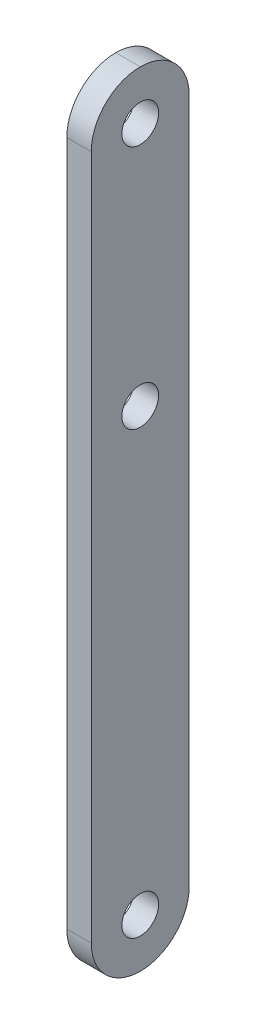
ISO-10303-21;
HEADER;
FILE_DESCRIPTION(('STEP AP214'),'2;1');
FILE_NAME('part.step','',(''),(''),'','','');
FILE_SCHEMA(('AUTOMOTIVE_DESIGN { 1 0 10303 214 1 1 1 1 }'));
ENDSEC;
DATA;
#1=APPLICATION_CONTEXT('core data for automotive mechanical design processes');
#2=APPLICATION_PROTOCOL_DEFINITION('international standard','automotive_design',2000,#1);
#3=PRODUCT_CONTEXT('',#1,'mechanical');
#4=PRODUCT('Part','Part','',(#3));
#5=PRODUCT_RELATED_PRODUCT_CATEGORY('part','',(#4));
#6=PRODUCT_DEFINITION_FORMATION('','',#4);
#7=PRODUCT_DEFINITION_CONTEXT('part definition',#1,'design');
#8=PRODUCT_DEFINITION('design','',#6,#7);
#9=PRODUCT_DEFINITION_SHAPE('','',#8);
#10=(LENGTH_UNIT() NAMED_UNIT(*) SI_UNIT(.MILLI.,.METRE.));
#11=(NAMED_UNIT(*) PLANE_ANGLE_UNIT() SI_UNIT($,.RADIAN.));
#12=(NAMED_UNIT(*) SI_UNIT($,.STERADIAN.) SOLID_ANGLE_UNIT());
#13=UNCERTAINTY_MEASURE_WITH_UNIT(LENGTH_MEASURE(1.E-05),#10,'distance_accuracy_value','');
#14=(GEOMETRIC_REPRESENTATION_CONTEXT(3) GLOBAL_UNCERTAINTY_ASSIGNED_CONTEXT((#13)) GLOBAL_UNIT_ASSIGNED_CONTEXT((#10,
#11,#12)) REPRESENTATION_CONTEXT('',''));
#15=CARTESIAN_POINT('',(0.,0.,0.));
#16=DIRECTION('',(0.,0.,1.));
#17=DIRECTION('',(1.,0.,0.));
#18=AXIS2_PLACEMENT_3D('',#15,#16,#17);
#19=CARTESIAN_POINT('',(6.35,203.2,-25.4));
#20=DIRECTION('',(0.,0.,1.));
#21=DIRECTION('',(0.,-1.,0.));
#22=AXIS2_PLACEMENT_3D('',#19,#20,#21);
#23=PLANE('',#22);
#24=DIRECTION('',(0.,1.,0.));
#25=VECTOR('',#24,1.);
#26=CARTESIAN_POINT('',(6.35,203.2,-25.4));
#27=LINE('',#26,#25);
#28=CARTESIAN_POINT('',(6.35,-177.8,-25.4));
#29=VERTEX_POINT('',#28);
#30=CARTESIAN_POINT('',(6.35,177.8,-25.4));
#31=VERTEX_POINT('',#30);
#32=EDGE_CURVE('E106',#29,#31,#27,.T.);
#33=ORIENTED_EDGE('',*,*,#32,.F.);
#34=DIRECTION('',(-1.,0.,0.));
#35=VECTOR('',#34,1.);
#36=CARTESIAN_POINT('',(6.35,-177.8,-25.4));
#37=LINE('',#36,#35);
#38=CARTESIAN_POINT('',(-6.35,-177.8,-25.4));
#39=VERTEX_POINT('',#38);
#40=EDGE_CURVE('E92',#29,#39,#37,.T.);
#41=ORIENTED_EDGE('',*,*,#40,.T.);
#42=DIRECTION('',(0.,1.,0.));
#43=VECTOR('',#42,1.);
#44=CARTESIAN_POINT('',(-6.35,203.2,-25.4));
#45=LINE('',#44,#43);
#46=CARTESIAN_POINT('',(-6.35,177.8,-25.4));
#47=VERTEX_POINT('',#46);
#48=EDGE_CURVE('E103',#39,#47,#45,.T.);
#49=ORIENTED_EDGE('',*,*,#48,.T.);
#50=DIRECTION('',(-1.,0.,0.));
#51=VECTOR('',#50,1.);
#52=CARTESIAN_POINT('',(6.35,177.8,-25.4));
#53=LINE('',#52,#51);
#54=EDGE_CURVE('E108',#47,#31,#53,.F.);
#55=ORIENTED_EDGE('',*,*,#54,.T.);
#56=EDGE_LOOP('',(#33,#41,#49,#55));
#57=FACE_BOUND('',#56,.T.);
#58=ADVANCED_FACE('F33',(#57),#23,.F.);
#59=CARTESIAN_POINT('',(6.35,203.2,25.4));
#60=DIRECTION('',(0.,0.,-1.));
#61=DIRECTION('',(0.,1.,0.));
#62=AXIS2_PLACEMENT_3D('',#59,#60,#61);
#63=PLANE('',#62);
#64=DIRECTION('',(0.,-1.,0.));
#65=VECTOR('',#64,1.);
#66=CARTESIAN_POINT('',(-6.35,203.2,25.4));
#67=LINE('',#66,#65);
#68=CARTESIAN_POINT('',(-6.35,177.8,25.4));
#69=VERTEX_POINT('',#68);
#70=CARTESIAN_POINT('',(-6.35,-177.8,25.4));
#71=VERTEX_POINT('',#70);
#72=EDGE_CURVE('E112',#69,#71,#67,.T.);
#73=ORIENTED_EDGE('',*,*,#72,.T.);
#74=DIRECTION('',(-1.,0.,0.));
#75=VECTOR('',#74,1.);
#76=CARTESIAN_POINT('',(6.35,-177.8,25.4));
#77=LINE('',#76,#75);
#78=CARTESIAN_POINT('',(6.35,-177.8,25.4));
#79=VERTEX_POINT('',#78);
#80=EDGE_CURVE('E11',#71,#79,#77,.F.);
#81=ORIENTED_EDGE('',*,*,#80,.T.);
#82=DIRECTION('',(0.,-1.,0.));
#83=VECTOR('',#82,1.);
#84=CARTESIAN_POINT('',(6.35,203.2,25.4));
#85=LINE('',#84,#83);
#86=CARTESIAN_POINT('',(6.35,177.8,25.4));
#87=VERTEX_POINT('',#86);
#88=EDGE_CURVE('E120',#87,#79,#85,.T.);
#89=ORIENTED_EDGE('',*,*,#88,.F.);
#90=DIRECTION('',(-1.,0.,0.));
#91=VECTOR('',#90,1.);
#92=CARTESIAN_POINT('',(6.35,177.8,25.4));
#93=LINE('',#92,#91);
#94=EDGE_CURVE('E42',#87,#69,#93,.T.);
#95=ORIENTED_EDGE('',*,*,#94,.T.);
#96=EDGE_LOOP('',(#73,#81,#89,#95));
#97=FACE_BOUND('',#96,.T.);
#98=ADVANCED_FACE('F181',(#97),#63,.F.);
#99=CARTESIAN_POINT('',(6.35,0.,0.));
#100=DIRECTION('',(1.,0.,0.));
#101=DIRECTION('',(0.,0.,-1.));
#102=AXIS2_PLACEMENT_3D('',#99,#100,#101);
#103=PLANE('',#102);
#104=CARTESIAN_POINT('',(6.35,-177.8,0.));
#105=DIRECTION('',(1.,0.,0.));
#106=DIRECTION('',(0.,0.,-1.));
#107=AXIS2_PLACEMENT_3D('',#104,#105,#106);
#108=CIRCLE('',#107,9.52499999999998);
#109=CARTESIAN_POINT('',(6.35,-177.8,-9.52500000000003));
#110=VERTEX_POINT('',#109);
#111=EDGE_CURVE('E135',#110,#110,#108,.T.);
#112=ORIENTED_EDGE('',*,*,#111,.F.);
#113=EDGE_LOOP('',(#112));
#114=FACE_BOUND('',#113,.T.);
#115=CARTESIAN_POINT('',(6.35,50.8,0.));
#116=DIRECTION('',(1.,0.,0.));
#117=DIRECTION('',(0.,0.,-1.));
#118=AXIS2_PLACEMENT_3D('',#115,#116,#117);
#119=CIRCLE('',#118,9.52500000000001);
#120=CARTESIAN_POINT('',(6.35,50.8,-9.52500000000002));
#121=VERTEX_POINT('',#120);
#122=EDGE_CURVE('E154',#121,#121,#119,.T.);
#123=ORIENTED_EDGE('',*,*,#122,.F.);
#124=EDGE_LOOP('',(#123));
#125=FACE_BOUND('',#124,.T.);
#126=CARTESIAN_POINT('',(6.35,177.8,0.));
#127=DIRECTION('',(1.,0.,0.));
#128=DIRECTION('',(0.,0.,-1.));
#129=AXIS2_PLACEMENT_3D('',#126,#127,#128);
#130=CIRCLE('',#129,9.52499999999999);
#131=CARTESIAN_POINT('',(6.35,177.8,-9.52500000000003));
#132=VERTEX_POINT('',#131);
#133=EDGE_CURVE('E117',#132,#132,#130,.T.);
#134=ORIENTED_EDGE('',*,*,#133,.F.);
#135=EDGE_LOOP('',(#134));
#136=FACE_BOUND('',#135,.T.);
#137=CARTESIAN_POINT('',(6.35,-177.8,0.));
#138=DIRECTION('',(1.,0.,0.));
#139=DIRECTION('',(0.,0.,-1.));
#140=AXIS2_PLACEMENT_3D('',#137,#138,#139);
#141=CIRCLE('',#140,25.4);
#142=CARTESIAN_POINT('',(6.35,-203.2,0.));
#143=VERTEX_POINT('',#142);
#144=EDGE_CURVE('E50',#79,#143,#141,.T.);
#145=ORIENTED_EDGE('',*,*,#144,.T.);
#146=CARTESIAN_POINT('',(6.35,-177.8,0.));
#147=DIRECTION('',(1.,0.,0.));
#148=DIRECTION('',(0.,0.,-1.));
#149=AXIS2_PLACEMENT_3D('',#146,#147,#148);
#150=CIRCLE('',#149,25.4);
#151=EDGE_CURVE('E132',#143,#29,#150,.T.);
#152=ORIENTED_EDGE('',*,*,#151,.T.);
#153=ORIENTED_EDGE('',*,*,#32,.T.);
#154=CARTESIAN_POINT('',(6.35,177.8,0.));
#155=DIRECTION('',(1.,0.,0.));
#156=DIRECTION('',(0.,0.,-1.));
#157=AXIS2_PLACEMENT_3D('',#154,#155,#156);
#158=CIRCLE('',#157,25.4);
#159=CARTESIAN_POINT('',(6.35,203.2,0.));
#160=VERTEX_POINT('',#159);
#161=EDGE_CURVE('E97',#31,#160,#158,.T.);
#162=ORIENTED_EDGE('',*,*,#161,.T.);
#163=CARTESIAN_POINT('',(6.35,177.8,0.));
#164=DIRECTION('',(1.,0.,0.));
#165=DIRECTION('',(0.,0.,-1.));
#166=AXIS2_PLACEMENT_3D('',#163,#164,#165);
#167=CIRCLE('',#166,25.4);
#168=EDGE_CURVE('E129',#160,#87,#167,.T.);
#169=ORIENTED_EDGE('',*,*,#168,.T.);
#170=ORIENTED_EDGE('',*,*,#88,.T.);
#171=EDGE_LOOP('',(#145,#152,#153,#162,#169,#170));
#172=FACE_BOUND('',#171,.T.);
#173=ADVANCED_FACE('F147',(#114,#125,#136,#172),#103,.T.);
#174=CARTESIAN_POINT('',(-6.35,0.,0.));
#175=DIRECTION('',(1.,0.,0.));
#176=DIRECTION('',(0.,0.,-1.));
#177=AXIS2_PLACEMENT_3D('',#174,#175,#176);
#178=PLANE('',#177);
#179=CARTESIAN_POINT('',(-6.35,-177.8,0.));
#180=DIRECTION('',(1.,0.,0.));
#181=DIRECTION('',(0.,0.,-1.));
#182=AXIS2_PLACEMENT_3D('',#179,#180,#181);
#183=CIRCLE('',#182,9.52499999999998);
#184=CARTESIAN_POINT('',(-6.35,-177.8,-9.52500000000003));
#185=VERTEX_POINT('',#184);
#186=EDGE_CURVE('E137',#185,#185,#183,.F.);
#187=ORIENTED_EDGE('',*,*,#186,.F.);
#188=EDGE_LOOP('',(#187));
#189=FACE_BOUND('',#188,.T.);
#190=CARTESIAN_POINT('',(-6.35,50.8,0.));
#191=DIRECTION('',(1.,0.,0.));
#192=DIRECTION('',(0.,0.,-1.));
#193=AXIS2_PLACEMENT_3D('',#190,#191,#192);
#194=CIRCLE('',#193,9.52500000000001);
#195=CARTESIAN_POINT('',(-6.35,50.8,-9.52500000000002));
#196=VERTEX_POINT('',#195);
#197=EDGE_CURVE('E151',#196,#196,#194,.F.);
#198=ORIENTED_EDGE('',*,*,#197,.F.);
#199=EDGE_LOOP('',(#198));
#200=FACE_BOUND('',#199,.T.);
#201=CARTESIAN_POINT('',(-6.35,177.8,0.));
#202=DIRECTION('',(1.,0.,0.));
#203=DIRECTION('',(0.,0.,-1.));
#204=AXIS2_PLACEMENT_3D('',#201,#202,#203);
#205=CIRCLE('',#204,9.52499999999999);
#206=CARTESIAN_POINT('',(-6.35,177.8,-9.52500000000003));
#207=VERTEX_POINT('',#206);
#208=EDGE_CURVE('E113',#207,#207,#205,.F.);
#209=ORIENTED_EDGE('',*,*,#208,.F.);
#210=EDGE_LOOP('',(#209));
#211=FACE_BOUND('',#210,.T.);
#212=ORIENTED_EDGE('',*,*,#48,.F.);
#213=CARTESIAN_POINT('',(-6.35,-177.8,0.));
#214=DIRECTION('',(1.,0.,0.));
#215=DIRECTION('',(0.,0.,-1.));
#216=AXIS2_PLACEMENT_3D('',#213,#214,#215);
#217=CIRCLE('',#216,25.4);
#218=CARTESIAN_POINT('',(-6.35,-203.2,0.));
#219=VERTEX_POINT('',#218);
#220=EDGE_CURVE('E88',#39,#219,#217,.F.);
#221=ORIENTED_EDGE('',*,*,#220,.T.);
#222=CARTESIAN_POINT('',(-6.35,-177.8,0.));
#223=DIRECTION('',(1.,0.,0.));
#224=DIRECTION('',(0.,0.,-1.));
#225=AXIS2_PLACEMENT_3D('',#222,#223,#224);
#226=CIRCLE('',#225,25.4);
#227=EDGE_CURVE('E98',#219,#71,#226,.F.);
#228=ORIENTED_EDGE('',*,*,#227,.T.);
#229=ORIENTED_EDGE('',*,*,#72,.F.);
#230=CARTESIAN_POINT('',(-6.35,177.8,0.));
#231=DIRECTION('',(1.,0.,0.));
#232=DIRECTION('',(0.,0.,-1.));
#233=AXIS2_PLACEMENT_3D('',#230,#231,#232);
#234=CIRCLE('',#233,25.4);
#235=CARTESIAN_POINT('',(-6.35,203.2,0.));
#236=VERTEX_POINT('',#235);
#237=EDGE_CURVE('E125',#69,#236,#234,.F.);
#238=ORIENTED_EDGE('',*,*,#237,.T.);
#239=CARTESIAN_POINT('',(-6.35,177.8,0.));
#240=DIRECTION('',(1.,0.,0.));
#241=DIRECTION('',(0.,0.,-1.));
#242=AXIS2_PLACEMENT_3D('',#239,#240,#241);
#243=CIRCLE('',#242,25.4);
#244=EDGE_CURVE('E107',#236,#47,#243,.F.);
#245=ORIENTED_EDGE('',*,*,#244,.T.);
#246=EDGE_LOOP('',(#212,#221,#228,#229,#238,#245));
#247=FACE_BOUND('',#246,.T.);
#248=ADVANCED_FACE('F110',(#189,#200,#211,#247),#178,.F.);
#249=CARTESIAN_POINT('',(-6.351,177.8,0.));
#250=DIRECTION('',(1.,0.,0.));
#251=DIRECTION('',(0.,0.,-1.));
#252=AXIS2_PLACEMENT_3D('',#249,#250,#251);
#253=CYLINDRICAL_SURFACE('',#252,9.52499999999999);
#254=ORIENTED_EDGE('',*,*,#133,.T.);
#255=EDGE_LOOP('',(#254));
#256=FACE_BOUND('',#255,.T.);
#257=ORIENTED_EDGE('',*,*,#208,.T.);
#258=EDGE_LOOP('',(#257));
#259=FACE_BOUND('',#258,.T.);
#260=ADVANCED_FACE('F164',(#256,#259),#253,.F.);
#261=CARTESIAN_POINT('',(-6.351,50.8,0.));
#262=DIRECTION('',(1.,0.,0.));
#263=DIRECTION('',(0.,0.,-1.));
#264=AXIS2_PLACEMENT_3D('',#261,#262,#263);
#265=CYLINDRICAL_SURFACE('',#264,9.52500000000001);
#266=ORIENTED_EDGE('',*,*,#122,.T.);
#267=EDGE_LOOP('',(#266));
#268=FACE_BOUND('',#267,.T.);
#269=ORIENTED_EDGE('',*,*,#197,.T.);
#270=EDGE_LOOP('',(#269));
#271=FACE_BOUND('',#270,.T.);
#272=ADVANCED_FACE('F171',(#268,#271),#265,.F.);
#273=CARTESIAN_POINT('',(-6.351,-177.8,0.));
#274=DIRECTION('',(1.,0.,0.));
#275=DIRECTION('',(0.,0.,-1.));
#276=AXIS2_PLACEMENT_3D('',#273,#274,#275);
#277=CYLINDRICAL_SURFACE('',#276,9.52499999999998);
#278=ORIENTED_EDGE('',*,*,#111,.T.);
#279=EDGE_LOOP('',(#278));
#280=FACE_BOUND('',#279,.T.);
#281=ORIENTED_EDGE('',*,*,#186,.T.);
#282=EDGE_LOOP('',(#281));
#283=FACE_BOUND('',#282,.T.);
#284=ADVANCED_FACE('F160',(#280,#283),#277,.F.);
#285=CARTESIAN_POINT('',(6.35,-177.8,0.));
#286=DIRECTION('',(-1.,0.,0.));
#287=DIRECTION('',(0.,0.,1.));
#288=AXIS2_PLACEMENT_3D('',#285,#286,#287);
#289=CYLINDRICAL_SURFACE('',#288,25.4);
#290=DIRECTION('',(-1.,0.,0.));
#291=VECTOR('',#290,1.);
#292=CARTESIAN_POINT('',(6.35,-203.2,0.));
#293=LINE('',#292,#291);
#294=EDGE_CURVE('E93',#143,#219,#293,.T.);
#295=ORIENTED_EDGE('',*,*,#294,.F.);
#296=ORIENTED_EDGE('',*,*,#144,.F.);
#297=ORIENTED_EDGE('',*,*,#80,.F.);
#298=ORIENTED_EDGE('',*,*,#227,.F.);
#299=EDGE_LOOP('',(#295,#296,#297,#298));
#300=FACE_BOUND('',#299,.T.);
#301=ADVANCED_FACE('F190',(#300),#289,.T.);
#302=CARTESIAN_POINT('',(6.35,-177.8,0.));
#303=DIRECTION('',(-1.,0.,0.));
#304=DIRECTION('',(0.,0.,1.));
#305=AXIS2_PLACEMENT_3D('',#302,#303,#304);
#306=CYLINDRICAL_SURFACE('',#305,25.4);
#307=ORIENTED_EDGE('',*,*,#151,.F.);
#308=ORIENTED_EDGE('',*,*,#294,.T.);
#309=ORIENTED_EDGE('',*,*,#220,.F.);
#310=ORIENTED_EDGE('',*,*,#40,.F.);
#311=EDGE_LOOP('',(#307,#308,#309,#310));
#312=FACE_BOUND('',#311,.T.);
#313=ADVANCED_FACE('F91',(#312),#306,.T.);
#314=CARTESIAN_POINT('',(6.35,177.8,0.));
#315=DIRECTION('',(-1.,0.,0.));
#316=DIRECTION('',(0.,0.,1.));
#317=AXIS2_PLACEMENT_3D('',#314,#315,#316);
#318=CYLINDRICAL_SURFACE('',#317,25.4);
#319=DIRECTION('',(-1.,0.,0.));
#320=VECTOR('',#319,1.);
#321=CARTESIAN_POINT('',(6.35,203.2,0.));
#322=LINE('',#321,#320);
#323=EDGE_CURVE('E37',#160,#236,#322,.T.);
#324=ORIENTED_EDGE('',*,*,#323,.F.);
#325=ORIENTED_EDGE('',*,*,#161,.F.);
#326=ORIENTED_EDGE('',*,*,#54,.F.);
#327=ORIENTED_EDGE('',*,*,#244,.F.);
#328=EDGE_LOOP('',(#324,#325,#326,#327));
#329=FACE_BOUND('',#328,.T.);
#330=ADVANCED_FACE('F35',(#329),#318,.T.);
#331=CARTESIAN_POINT('',(6.35,177.8,0.));
#332=DIRECTION('',(-1.,0.,0.));
#333=DIRECTION('',(0.,0.,1.));
#334=AXIS2_PLACEMENT_3D('',#331,#332,#333);
#335=CYLINDRICAL_SURFACE('',#334,25.4);
#336=ORIENTED_EDGE('',*,*,#168,.F.);
#337=ORIENTED_EDGE('',*,*,#323,.T.);
#338=ORIENTED_EDGE('',*,*,#237,.F.);
#339=ORIENTED_EDGE('',*,*,#94,.F.);
#340=EDGE_LOOP('',(#336,#337,#338,#339));
#341=FACE_BOUND('',#340,.T.);
#342=ADVANCED_FACE('F143',(#341),#335,.T.);
#343=CLOSED_SHELL('',(#58,#98,#173,#248,#260,#272,#284,#301,#313,#330,#342));
#344=MANIFOLD_SOLID_BREP('B2',#343);
#345=ADVANCED_BREP_SHAPE_REPRESENTATION('',(#18,#344),#14);
#346=SHAPE_DEFINITION_REPRESENTATION(#9,#345);
ENDSEC;
END-ISO-10303-21;
